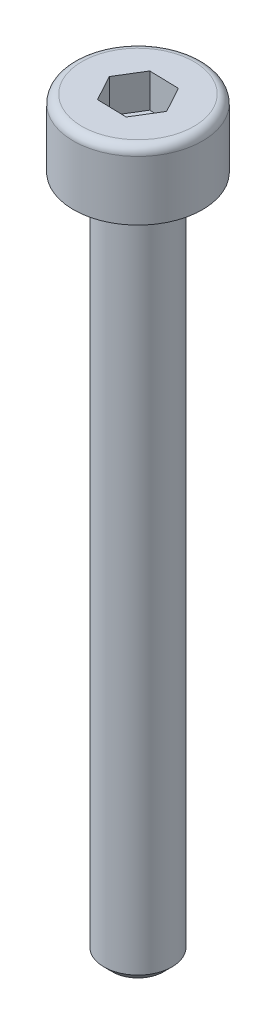
ISO-10303-21;
HEADER;
FILE_DESCRIPTION(('STEP AP214'),'2;1');
FILE_NAME('part.step','',(''),(''),'','','');
FILE_SCHEMA(('AUTOMOTIVE_DESIGN { 1 0 10303 214 1 1 1 1 }'));
ENDSEC;
DATA;
#1=APPLICATION_CONTEXT('core data for automotive mechanical design processes');
#2=APPLICATION_PROTOCOL_DEFINITION('international standard','automotive_design',2000,#1);
#3=PRODUCT_CONTEXT('',#1,'mechanical');
#4=PRODUCT('Part','Part','',(#3));
#5=PRODUCT_RELATED_PRODUCT_CATEGORY('part','',(#4));
#6=PRODUCT_DEFINITION_FORMATION('','',#4);
#7=PRODUCT_DEFINITION_CONTEXT('part definition',#1,'design');
#8=PRODUCT_DEFINITION('design','',#6,#7);
#9=PRODUCT_DEFINITION_SHAPE('','',#8);
#10=(LENGTH_UNIT() NAMED_UNIT(*) SI_UNIT(.MILLI.,.METRE.));
#11=(NAMED_UNIT(*) PLANE_ANGLE_UNIT() SI_UNIT($,.RADIAN.));
#12=(NAMED_UNIT(*) SI_UNIT($,.STERADIAN.) SOLID_ANGLE_UNIT());
#13=UNCERTAINTY_MEASURE_WITH_UNIT(LENGTH_MEASURE(1.E-05),#10,'distance_accuracy_value','');
#14=(GEOMETRIC_REPRESENTATION_CONTEXT(3) GLOBAL_UNCERTAINTY_ASSIGNED_CONTEXT((#13)) GLOBAL_UNIT_ASSIGNED_CONTEXT((#10,
#11,#12)) REPRESENTATION_CONTEXT('',''));
#15=CARTESIAN_POINT('',(0.,0.,0.));
#16=DIRECTION('',(0.,0.,1.));
#17=DIRECTION('',(1.,0.,0.));
#18=AXIS2_PLACEMENT_3D('',#15,#16,#17);
#19=CARTESIAN_POINT('',(0.,2.,0.));
#20=DIRECTION('',(0.,-1.,0.));
#21=DIRECTION('',(0.,0.,-1.));
#22=AXIS2_PLACEMENT_3D('',#19,#20,#21);
#23=CYLINDRICAL_SURFACE('',#22,1.9);
#24=CARTESIAN_POINT('',(0.,1.75,0.));
#25=DIRECTION('',(0.,1.,0.));
#26=DIRECTION('',(0.,0.,1.));
#27=AXIS2_PLACEMENT_3D('',#24,#25,#26);
#28=CIRCLE('',#27,1.9);
#29=CARTESIAN_POINT('',(0.,1.75,1.9));
#30=VERTEX_POINT('',#29);
#31=EDGE_CURVE('E149',#30,#30,#28,.F.);
#32=ORIENTED_EDGE('',*,*,#31,.T.);
#33=EDGE_LOOP('',(#32));
#34=FACE_BOUND('',#33,.T.);
#35=CARTESIAN_POINT('',(0.,0.,0.));
#36=DIRECTION('',(0.,1.,0.));
#37=DIRECTION('',(0.,0.,1.));
#38=AXIS2_PLACEMENT_3D('',#35,#36,#37);
#39=CIRCLE('',#38,1.9);
#40=CARTESIAN_POINT('',(0.,0.,1.9));
#41=VERTEX_POINT('',#40);
#42=EDGE_CURVE('E140',#41,#41,#39,.T.);
#43=ORIENTED_EDGE('',*,*,#42,.T.);
#44=EDGE_LOOP('',(#43));
#45=FACE_BOUND('',#44,.T.);
#46=ADVANCED_FACE('F38',(#34,#45),#23,.T.);
#47=CARTESIAN_POINT('',(0.,2.,0.));
#48=DIRECTION('',(0.,1.,0.));
#49=DIRECTION('',(0.,0.,1.));
#50=AXIS2_PLACEMENT_3D('',#47,#48,#49);
#51=PLANE('',#50);
#52=DIRECTION('',(-0.477309128780898,0.,-0.878735452558061));
#53=VECTOR('',#52,1.);
#54=CARTESIAN_POINT('',(0.865732504909784,2.,0.0225217659749745));
#55=LINE('',#54,#53);
#56=CARTESIAN_POINT('',(0.865732504909784,2.,0.0225217659749745));
#57=VERTEX_POINT('',#56);
#58=CARTESIAN_POINT('',(0.452370673927308,2.,-0.738485459146322));
#59=VERTEX_POINT('',#58);
#60=EDGE_CURVE('E53',#57,#59,#55,.T.);
#61=ORIENTED_EDGE('',*,*,#60,.F.);
#62=DIRECTION('',(0.522352660730847,0.,-0.852729557261506));
#63=VECTOR('',#62,1.);
#64=CARTESIAN_POINT('',(0.413361830982476,2.,0.761007225121296));
#65=LINE('',#64,#63);
#66=CARTESIAN_POINT('',(0.413361830982476,2.,0.761007225121296));
#67=VERTEX_POINT('',#66);
#68=EDGE_CURVE('E136',#67,#57,#65,.T.);
#69=ORIENTED_EDGE('',*,*,#68,.F.);
#70=DIRECTION('',(0.999661789511745,0.,0.0260058952965545));
#71=VECTOR('',#70,1.);
#72=CARTESIAN_POINT('',(-0.452370673927308,2.,0.738485459146322));
#73=LINE('',#72,#71);
#74=CARTESIAN_POINT('',(-0.452370673927308,2.,0.738485459146322));
#75=VERTEX_POINT('',#74);
#76=EDGE_CURVE('E134',#75,#67,#73,.T.);
#77=ORIENTED_EDGE('',*,*,#76,.F.);
#78=DIRECTION('',(0.477309128780898,0.,0.878735452558061));
#79=VECTOR('',#78,1.);
#80=CARTESIAN_POINT('',(-0.865732504909783,2.,-0.0225217659749746));
#81=LINE('',#80,#79);
#82=CARTESIAN_POINT('',(-0.865732504909783,2.,-0.0225217659749746));
#83=VERTEX_POINT('',#82);
#84=EDGE_CURVE('E101',#83,#75,#81,.T.);
#85=ORIENTED_EDGE('',*,*,#84,.F.);
#86=DIRECTION('',(-0.522352660730847,0.,0.852729557261506));
#87=VECTOR('',#86,1.);
#88=CARTESIAN_POINT('',(-0.413361830982476,2.,-0.761007225121296));
#89=LINE('',#88,#87);
#90=CARTESIAN_POINT('',(-0.413361830982476,2.,-0.761007225121296));
#91=VERTEX_POINT('',#90);
#92=EDGE_CURVE('E130',#91,#83,#89,.T.);
#93=ORIENTED_EDGE('',*,*,#92,.F.);
#94=DIRECTION('',(-0.999661789511745,0.,-0.0260058952965545));
#95=VECTOR('',#94,1.);
#96=CARTESIAN_POINT('',(0.452370673927308,2.,-0.738485459146322));
#97=LINE('',#96,#95);
#98=EDGE_CURVE('E127',#59,#91,#97,.T.);
#99=ORIENTED_EDGE('',*,*,#98,.F.);
#100=EDGE_LOOP('',(#61,#69,#77,#85,#93,#99));
#101=FACE_BOUND('',#100,.T.);
#102=CARTESIAN_POINT('',(0.,2.,0.));
#103=DIRECTION('',(0.,1.,0.));
#104=DIRECTION('',(0.,0.,1.));
#105=AXIS2_PLACEMENT_3D('',#102,#103,#104);
#106=CIRCLE('',#105,1.65);
#107=CARTESIAN_POINT('',(0.,2.,1.65));
#108=VERTEX_POINT('',#107);
#109=EDGE_CURVE('E152',#108,#108,#106,.T.);
#110=ORIENTED_EDGE('',*,*,#109,.T.);
#111=EDGE_LOOP('',(#110));
#112=FACE_BOUND('',#111,.T.);
#113=ADVANCED_FACE('F170',(#101,#112),#51,.T.);
#114=CARTESIAN_POINT('',(0.,0.,0.));
#115=DIRECTION('',(0.,1.,0.));
#116=DIRECTION('',(0.,0.,1.));
#117=AXIS2_PLACEMENT_3D('',#114,#115,#116);
#118=PLANE('',#117);
#119=CARTESIAN_POINT('',(0.,0.,0.));
#120=DIRECTION('',(0.,-1.,0.));
#121=DIRECTION('',(0.,0.,-1.));
#122=AXIS2_PLACEMENT_3D('',#119,#120,#121);
#123=CIRCLE('',#122,1.);
#124=CARTESIAN_POINT('',(0.,0.,-1.));
#125=VERTEX_POINT('',#124);
#126=EDGE_CURVE('E146',#125,#125,#123,.T.);
#127=ORIENTED_EDGE('',*,*,#126,.F.);
#128=EDGE_LOOP('',(#127));
#129=FACE_BOUND('',#128,.T.);
#130=ORIENTED_EDGE('',*,*,#42,.F.);
#131=EDGE_LOOP('',(#130));
#132=FACE_BOUND('',#131,.T.);
#133=ADVANCED_FACE('F176',(#129,#132),#118,.F.);
#134=CARTESIAN_POINT('',(0.,1.75,0.));
#135=DIRECTION('',(0.,1.,0.));
#136=DIRECTION('',(0.,0.,1.));
#137=AXIS2_PLACEMENT_3D('',#134,#135,#136);
#138=TOROIDAL_SURFACE('',#137,1.65,0.25);
#139=ORIENTED_EDGE('',*,*,#31,.F.);
#140=EDGE_LOOP('',(#139));
#141=FACE_BOUND('',#140,.T.);
#142=ORIENTED_EDGE('',*,*,#109,.F.);
#143=EDGE_LOOP('',(#142));
#144=FACE_BOUND('',#143,.T.);
#145=ADVANCED_FACE('F181',(#141,#144),#138,.T.);
#146=CARTESIAN_POINT('',(0.,-20.,0.));
#147=DIRECTION('',(0.,1.,0.));
#148=DIRECTION('',(0.,0.,1.));
#149=AXIS2_PLACEMENT_3D('',#146,#147,#148);
#150=CYLINDRICAL_SURFACE('',#149,1.);
#151=CARTESIAN_POINT('',(0.,-19.75,0.));
#152=DIRECTION('',(0.,-1.,0.));
#153=DIRECTION('',(0.,0.,-1.));
#154=AXIS2_PLACEMENT_3D('',#151,#152,#153);
#155=CIRCLE('',#154,1.);
#156=CARTESIAN_POINT('',(0.,-19.75,-1.));
#157=VERTEX_POINT('',#156);
#158=EDGE_CURVE('E11',#157,#157,#155,.F.);
#159=ORIENTED_EDGE('',*,*,#158,.T.);
#160=EDGE_LOOP('',(#159));
#161=FACE_BOUND('',#160,.T.);
#162=ORIENTED_EDGE('',*,*,#126,.T.);
#163=EDGE_LOOP('',(#162));
#164=FACE_BOUND('',#163,.T.);
#165=ADVANCED_FACE('F183',(#161,#164),#150,.T.);
#166=CARTESIAN_POINT('',(0.,-20.,0.));
#167=DIRECTION('',(0.,-1.,0.));
#168=DIRECTION('',(0.,0.,-1.));
#169=AXIS2_PLACEMENT_3D('',#166,#167,#168);
#170=PLANE('',#169);
#171=CARTESIAN_POINT('',(0.,-20.,0.));
#172=DIRECTION('',(0.,-1.,0.));
#173=DIRECTION('',(0.,0.,-1.));
#174=AXIS2_PLACEMENT_3D('',#171,#172,#173);
#175=CIRCLE('',#174,0.749999999999997);
#176=CARTESIAN_POINT('',(0.,-20.,-0.749999999999997));
#177=VERTEX_POINT('',#176);
#178=EDGE_CURVE('E46',#177,#177,#175,.T.);
#179=ORIENTED_EDGE('',*,*,#178,.T.);
#180=EDGE_LOOP('',(#179));
#181=FACE_BOUND('',#180,.T.);
#182=ADVANCED_FACE('F159',(#181),#170,.T.);
#183=CARTESIAN_POINT('',(0.865732504909784,1.,0.0225217659749745));
#184=DIRECTION('',(0.878735452558061,0.,-0.477309128780898));
#185=DIRECTION('',(-0.477309128780898,0.,-0.878735452558061));
#186=AXIS2_PLACEMENT_3D('',#183,#184,#185);
#187=PLANE('',#186);
#188=ORIENTED_EDGE('',*,*,#60,.T.);
#189=DIRECTION('',(0.,1.,0.));
#190=VECTOR('',#189,1.);
#191=CARTESIAN_POINT('',(0.452370673927308,1.,-0.738485459146322));
#192=LINE('',#191,#190);
#193=CARTESIAN_POINT('',(0.452370673927308,1.,-0.738485459146322));
#194=VERTEX_POINT('',#193);
#195=EDGE_CURVE('E83',#194,#59,#192,.T.);
#196=ORIENTED_EDGE('',*,*,#195,.F.);
#197=DIRECTION('',(-0.477309128780898,0.,-0.878735452558061));
#198=VECTOR('',#197,1.);
#199=CARTESIAN_POINT('',(0.865732504909784,1.,0.0225217659749745));
#200=LINE('',#199,#198);
#201=CARTESIAN_POINT('',(0.865732504909784,1.,0.0225217659749745));
#202=VERTEX_POINT('',#201);
#203=EDGE_CURVE('E138',#202,#194,#200,.T.);
#204=ORIENTED_EDGE('',*,*,#203,.F.);
#205=DIRECTION('',(0.,1.,0.));
#206=VECTOR('',#205,1.);
#207=CARTESIAN_POINT('',(0.865732504909784,1.,0.0225217659749745));
#208=LINE('',#207,#206);
#209=EDGE_CURVE('E61',#202,#57,#208,.T.);
#210=ORIENTED_EDGE('',*,*,#209,.T.);
#211=EDGE_LOOP('',(#188,#196,#204,#210));
#212=FACE_BOUND('',#211,.T.);
#213=ADVANCED_FACE('F212',(#212),#187,.F.);
#214=CARTESIAN_POINT('',(0.413361830982476,1.,0.761007225121296));
#215=DIRECTION('',(0.852729557261506,0.,0.522352660730847));
#216=DIRECTION('',(0.522352660730847,0.,-0.852729557261506));
#217=AXIS2_PLACEMENT_3D('',#214,#215,#216);
#218=PLANE('',#217);
#219=ORIENTED_EDGE('',*,*,#68,.T.);
#220=ORIENTED_EDGE('',*,*,#209,.F.);
#221=DIRECTION('',(0.522352660730847,0.,-0.852729557261506));
#222=VECTOR('',#221,1.);
#223=CARTESIAN_POINT('',(0.413361830982476,1.,0.761007225121296));
#224=LINE('',#223,#222);
#225=CARTESIAN_POINT('',(0.413361830982476,1.,0.761007225121296));
#226=VERTEX_POINT('',#225);
#227=EDGE_CURVE('E113',#226,#202,#224,.T.);
#228=ORIENTED_EDGE('',*,*,#227,.F.);
#229=DIRECTION('',(0.,1.,0.));
#230=VECTOR('',#229,1.);
#231=CARTESIAN_POINT('',(0.413361830982476,1.,0.761007225121296));
#232=LINE('',#231,#230);
#233=EDGE_CURVE('E105',#226,#67,#232,.T.);
#234=ORIENTED_EDGE('',*,*,#233,.T.);
#235=EDGE_LOOP('',(#219,#220,#228,#234));
#236=FACE_BOUND('',#235,.T.);
#237=ADVANCED_FACE('F217',(#236),#218,.F.);
#238=CARTESIAN_POINT('',(-0.452370673927308,1.,0.738485459146322));
#239=DIRECTION('',(-0.0260058952965545,0.,0.999661789511745));
#240=DIRECTION('',(0.999661789511745,0.,0.0260058952965545));
#241=AXIS2_PLACEMENT_3D('',#238,#239,#240);
#242=PLANE('',#241);
#243=ORIENTED_EDGE('',*,*,#76,.T.);
#244=ORIENTED_EDGE('',*,*,#233,.F.);
#245=DIRECTION('',(0.999661789511745,0.,0.0260058952965545));
#246=VECTOR('',#245,1.);
#247=CARTESIAN_POINT('',(-0.452370673927308,1.,0.738485459146322));
#248=LINE('',#247,#246);
#249=CARTESIAN_POINT('',(-0.452370673927308,1.,0.738485459146322));
#250=VERTEX_POINT('',#249);
#251=EDGE_CURVE('E109',#250,#226,#248,.T.);
#252=ORIENTED_EDGE('',*,*,#251,.F.);
#253=DIRECTION('',(0.,1.,0.));
#254=VECTOR('',#253,1.);
#255=CARTESIAN_POINT('',(-0.452370673927308,1.,0.738485459146322));
#256=LINE('',#255,#254);
#257=EDGE_CURVE('E94',#250,#75,#256,.T.);
#258=ORIENTED_EDGE('',*,*,#257,.T.);
#259=EDGE_LOOP('',(#243,#244,#252,#258));
#260=FACE_BOUND('',#259,.T.);
#261=ADVANCED_FACE('F110',(#260),#242,.F.);
#262=CARTESIAN_POINT('',(-0.865732504909783,1.,-0.0225217659749746));
#263=DIRECTION('',(-0.878735452558061,0.,0.477309128780898));
#264=DIRECTION('',(0.477309128780898,0.,0.878735452558061));
#265=AXIS2_PLACEMENT_3D('',#262,#263,#264);
#266=PLANE('',#265);
#267=ORIENTED_EDGE('',*,*,#84,.T.);
#268=ORIENTED_EDGE('',*,*,#257,.F.);
#269=DIRECTION('',(0.477309128780898,0.,0.878735452558061));
#270=VECTOR('',#269,1.);
#271=CARTESIAN_POINT('',(-0.865732504909783,1.,-0.0225217659749746));
#272=LINE('',#271,#270);
#273=CARTESIAN_POINT('',(-0.865732504909783,1.,-0.0225217659749746));
#274=VERTEX_POINT('',#273);
#275=EDGE_CURVE('E98',#274,#250,#272,.T.);
#276=ORIENTED_EDGE('',*,*,#275,.F.);
#277=DIRECTION('',(0.,1.,0.));
#278=VECTOR('',#277,1.);
#279=CARTESIAN_POINT('',(-0.865732504909783,1.,-0.0225217659749746));
#280=LINE('',#279,#278);
#281=EDGE_CURVE('E106',#274,#83,#280,.T.);
#282=ORIENTED_EDGE('',*,*,#281,.T.);
#283=EDGE_LOOP('',(#267,#268,#276,#282));
#284=FACE_BOUND('',#283,.T.);
#285=ADVANCED_FACE('F96',(#284),#266,.F.);
#286=CARTESIAN_POINT('',(-0.413361830982476,1.,-0.761007225121296));
#287=DIRECTION('',(-0.852729557261506,0.,-0.522352660730847));
#288=DIRECTION('',(-0.522352660730847,0.,0.852729557261506));
#289=AXIS2_PLACEMENT_3D('',#286,#287,#288);
#290=PLANE('',#289);
#291=ORIENTED_EDGE('',*,*,#92,.T.);
#292=ORIENTED_EDGE('',*,*,#281,.F.);
#293=DIRECTION('',(-0.522352660730847,0.,0.852729557261506));
#294=VECTOR('',#293,1.);
#295=CARTESIAN_POINT('',(-0.413361830982476,1.,-0.761007225121296));
#296=LINE('',#295,#294);
#297=CARTESIAN_POINT('',(-0.413361830982476,1.,-0.761007225121296));
#298=VERTEX_POINT('',#297);
#299=EDGE_CURVE('E119',#298,#274,#296,.T.);
#300=ORIENTED_EDGE('',*,*,#299,.F.);
#301=DIRECTION('',(0.,1.,0.));
#302=VECTOR('',#301,1.);
#303=CARTESIAN_POINT('',(-0.413361830982476,1.,-0.761007225121296));
#304=LINE('',#303,#302);
#305=EDGE_CURVE('E143',#298,#91,#304,.T.);
#306=ORIENTED_EDGE('',*,*,#305,.T.);
#307=EDGE_LOOP('',(#291,#292,#300,#306));
#308=FACE_BOUND('',#307,.T.);
#309=ADVANCED_FACE('F244',(#308),#290,.F.);
#310=CARTESIAN_POINT('',(0.452370673927308,1.,-0.738485459146322));
#311=DIRECTION('',(0.0260058952965545,0.,-0.999661789511745));
#312=DIRECTION('',(-0.999661789511745,0.,-0.0260058952965545));
#313=AXIS2_PLACEMENT_3D('',#310,#311,#312);
#314=PLANE('',#313);
#315=ORIENTED_EDGE('',*,*,#98,.T.);
#316=ORIENTED_EDGE('',*,*,#305,.F.);
#317=DIRECTION('',(-0.999661789511745,0.,-0.0260058952965545));
#318=VECTOR('',#317,1.);
#319=CARTESIAN_POINT('',(0.452370673927308,1.,-0.738485459146322));
#320=LINE('',#319,#318);
#321=EDGE_CURVE('E121',#194,#298,#320,.T.);
#322=ORIENTED_EDGE('',*,*,#321,.F.);
#323=ORIENTED_EDGE('',*,*,#195,.T.);
#324=EDGE_LOOP('',(#315,#316,#322,#323));
#325=FACE_BOUND('',#324,.T.);
#326=ADVANCED_FACE('F166',(#325),#314,.F.);
#327=CARTESIAN_POINT('',(0.,1.,0.));
#328=DIRECTION('',(0.,1.,0.));
#329=DIRECTION('',(0.,0.,1.));
#330=AXIS2_PLACEMENT_3D('',#327,#328,#329);
#331=PLANE('',#330);
#332=ORIENTED_EDGE('',*,*,#203,.T.);
#333=ORIENTED_EDGE('',*,*,#321,.T.);
#334=ORIENTED_EDGE('',*,*,#299,.T.);
#335=ORIENTED_EDGE('',*,*,#275,.T.);
#336=ORIENTED_EDGE('',*,*,#251,.T.);
#337=ORIENTED_EDGE('',*,*,#227,.T.);
#338=EDGE_LOOP('',(#332,#333,#334,#335,#336,#337));
#339=FACE_BOUND('',#338,.T.);
#340=ADVANCED_FACE('F116',(#339),#331,.T.);
#341=CARTESIAN_POINT('',(0.,-20.,0.));
#342=DIRECTION('',(0.,1.,0.));
#343=DIRECTION('',(0.,0.,1.));
#344=AXIS2_PLACEMENT_3D('',#341,#342,#343);
#345=CONICAL_SURFACE('',#344,0.749999999999997,0.785398163397447);
#346=ORIENTED_EDGE('',*,*,#158,.F.);
#347=EDGE_LOOP('',(#346));
#348=FACE_BOUND('',#347,.T.);
#349=ORIENTED_EDGE('',*,*,#178,.F.);
#350=EDGE_LOOP('',(#349));
#351=FACE_BOUND('',#350,.T.);
#352=ADVANCED_FACE('F40',(#348,#351),#345,.T.);
#353=CLOSED_SHELL('',(#46,#113,#133,#145,#165,#182,#213,#237,#261,#285,#309,#326,#340,#352));
#354=MANIFOLD_SOLID_BREP('B2',#353);
#355=ADVANCED_BREP_SHAPE_REPRESENTATION('',(#18,#354),#14);
#356=SHAPE_DEFINITION_REPRESENTATION(#9,#355);
ENDSEC;
END-ISO-10303-21;
